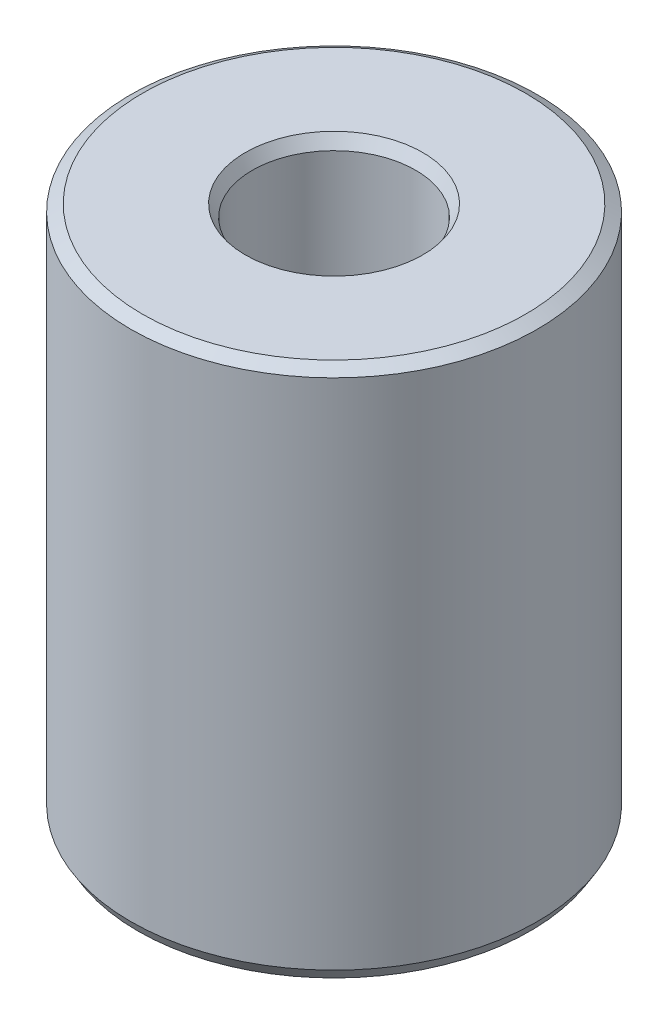
ISO-10303-21;
HEADER;
FILE_DESCRIPTION(('STEP AP214'),'2;1');
FILE_NAME('part.step','',(''),(''),'','','');
FILE_SCHEMA(('AUTOMOTIVE_DESIGN { 1 0 10303 214 1 1 1 1 }'));
ENDSEC;
DATA;
#1=APPLICATION_CONTEXT('core data for automotive mechanical design processes');
#2=APPLICATION_PROTOCOL_DEFINITION('international standard','automotive_design',2000,#1);
#3=PRODUCT_CONTEXT('',#1,'mechanical');
#4=PRODUCT('Part','Part','',(#3));
#5=PRODUCT_RELATED_PRODUCT_CATEGORY('part','',(#4));
#6=PRODUCT_DEFINITION_FORMATION('','',#4);
#7=PRODUCT_DEFINITION_CONTEXT('part definition',#1,'design');
#8=PRODUCT_DEFINITION('design','',#6,#7);
#9=PRODUCT_DEFINITION_SHAPE('','',#8);
#10=(LENGTH_UNIT() NAMED_UNIT(*) SI_UNIT(.MILLI.,.METRE.));
#11=(NAMED_UNIT(*) PLANE_ANGLE_UNIT() SI_UNIT($,.RADIAN.));
#12=(NAMED_UNIT(*) SI_UNIT($,.STERADIAN.) SOLID_ANGLE_UNIT());
#13=UNCERTAINTY_MEASURE_WITH_UNIT(LENGTH_MEASURE(1.E-05),#10,'distance_accuracy_value','');
#14=(GEOMETRIC_REPRESENTATION_CONTEXT(3) GLOBAL_UNCERTAINTY_ASSIGNED_CONTEXT((#13)) GLOBAL_UNIT_ASSIGNED_CONTEXT((#10,
#11,#12)) REPRESENTATION_CONTEXT('',''));
#15=CARTESIAN_POINT('',(0.,0.,0.));
#16=DIRECTION('',(0.,0.,1.));
#17=DIRECTION('',(1.,0.,0.));
#18=AXIS2_PLACEMENT_3D('',#15,#16,#17);
#19=CARTESIAN_POINT('',(0.,58.8666773430447,0.));
#20=DIRECTION('',(0.,-1.,0.));
#21=DIRECTION('',(0.,0.,-1.));
#22=AXIS2_PLACEMENT_3D('',#19,#20,#21);
#23=CYLINDRICAL_SURFACE('',#22,22.5);
#24=CARTESIAN_POINT('',(0.,1.30393393738187,0.));
#25=DIRECTION('',(0.,1.,0.));
#26=DIRECTION('',(0.,0.,1.));
#27=AXIS2_PLACEMENT_3D('',#24,#25,#26);
#28=CIRCLE('',#27,22.5);
#29=CARTESIAN_POINT('',(0.,1.30393393738187,22.5));
#30=VERTEX_POINT('',#29);
#31=EDGE_CURVE('E10',#30,#30,#28,.T.);
#32=ORIENTED_EDGE('',*,*,#31,.T.);
#33=EDGE_LOOP('',(#32));
#34=FACE_BOUND('',#33,.T.);
#35=CARTESIAN_POINT('',(0.,58.0814540573901,0.));
#36=DIRECTION('',(0.,1.,0.));
#37=DIRECTION('',(0.,0.,1.));
#38=AXIS2_PLACEMENT_3D('',#35,#36,#37);
#39=CIRCLE('',#38,22.5);
#40=CARTESIAN_POINT('',(0.,58.0814540573901,22.5));
#41=VERTEX_POINT('',#40);
#42=EDGE_CURVE('E50',#41,#41,#39,.F.);
#43=ORIENTED_EDGE('',*,*,#42,.T.);
#44=EDGE_LOOP('',(#43));
#45=FACE_BOUND('',#44,.T.);
#46=ADVANCED_FACE('F39',(#34,#45),#23,.T.);
#47=CARTESIAN_POINT('',(0.,58.8666773430447,0.));
#48=DIRECTION('',(0.,1.,0.));
#49=DIRECTION('',(0.,0.,1.));
#50=AXIS2_PLACEMENT_3D('',#47,#48,#49);
#51=PLANE('',#50);
#52=CARTESIAN_POINT('',(0.,58.8666773430447,0.));
#53=DIRECTION('',(0.,1.,0.));
#54=DIRECTION('',(0.,0.,1.));
#55=AXIS2_PLACEMENT_3D('',#52,#53,#54);
#56=CIRCLE('',#55,9.82424820602042);
#57=CARTESIAN_POINT('',(0.,58.8666773430447,9.82424820602042));
#58=VERTEX_POINT('',#57);
#59=EDGE_CURVE('E58',#58,#58,#56,.F.);
#60=ORIENTED_EDGE('',*,*,#59,.T.);
#61=EDGE_LOOP('',(#60));
#62=FACE_BOUND('',#61,.T.);
#63=CARTESIAN_POINT('',(0.,58.8666773430447,0.));
#64=DIRECTION('',(0.,1.,0.));
#65=DIRECTION('',(0.,0.,1.));
#66=AXIS2_PLACEMENT_3D('',#63,#64,#65);
#67=CIRCLE('',#66,21.1960660626182);
#68=CARTESIAN_POINT('',(0.,58.8666773430447,21.1960660626182));
#69=VERTEX_POINT('',#68);
#70=EDGE_CURVE('E61',#69,#69,#67,.T.);
#71=ORIENTED_EDGE('',*,*,#70,.T.);
#72=EDGE_LOOP('',(#71));
#73=FACE_BOUND('',#72,.T.);
#74=ADVANCED_FACE('F88',(#62,#73),#51,.T.);
#75=CARTESIAN_POINT('',(0.,0.,0.));
#76=DIRECTION('',(0.,1.,0.));
#77=DIRECTION('',(0.,0.,1.));
#78=AXIS2_PLACEMENT_3D('',#75,#76,#77);
#79=PLANE('',#78);
#80=CARTESIAN_POINT('',(0.,0.,0.));
#81=DIRECTION('',(0.,1.,0.));
#82=DIRECTION('',(0.,0.,1.));
#83=AXIS2_PLACEMENT_3D('',#80,#81,#82);
#84=CIRCLE('',#83,10.3429588577477);
#85=CARTESIAN_POINT('',(0.,0.,10.3429588577477));
#86=VERTEX_POINT('',#85);
#87=EDGE_CURVE('E51',#86,#86,#84,.T.);
#88=ORIENTED_EDGE('',*,*,#87,.T.);
#89=EDGE_LOOP('',(#88));
#90=FACE_BOUND('',#89,.T.);
#91=CARTESIAN_POINT('',(0.,0.,0.));
#92=DIRECTION('',(0.,1.,0.));
#93=DIRECTION('',(0.,0.,1.));
#94=AXIS2_PLACEMENT_3D('',#91,#92,#93);
#95=CIRCLE('',#94,21.7147767143454);
#96=CARTESIAN_POINT('',(0.,0.,21.7147767143454));
#97=VERTEX_POINT('',#96);
#98=EDGE_CURVE('E54',#97,#97,#95,.F.);
#99=ORIENTED_EDGE('',*,*,#98,.T.);
#100=EDGE_LOOP('',(#99));
#101=FACE_BOUND('',#100,.T.);
#102=ADVANCED_FACE('F83',(#90,#101),#79,.F.);
#103=CARTESIAN_POINT('',(0.,58.8666773430447,0.));
#104=DIRECTION('',(0.,-1.,0.));
#105=DIRECTION('',(0.,0.,-1.));
#106=AXIS2_PLACEMENT_3D('',#103,#104,#105);
#107=CYLINDRICAL_SURFACE('',#106,9.03902492036584);
#108=CARTESIAN_POINT('',(0.,57.5627434056629,0.));
#109=DIRECTION('',(0.,1.,0.));
#110=DIRECTION('',(0.,0.,1.));
#111=AXIS2_PLACEMENT_3D('',#108,#109,#110);
#112=CIRCLE('',#111,9.03902492036584);
#113=CARTESIAN_POINT('',(0.,57.5627434056629,9.03902492036584));
#114=VERTEX_POINT('',#113);
#115=EDGE_CURVE('E67',#114,#114,#112,.T.);
#116=ORIENTED_EDGE('',*,*,#115,.T.);
#117=EDGE_LOOP('',(#116));
#118=FACE_BOUND('',#117,.T.);
#119=CARTESIAN_POINT('',(0.,0.785223285654592,0.));
#120=DIRECTION('',(0.,1.,0.));
#121=DIRECTION('',(0.,0.,1.));
#122=AXIS2_PLACEMENT_3D('',#119,#120,#121);
#123=CIRCLE('',#122,9.03902492036584);
#124=CARTESIAN_POINT('',(0.,0.785223285654592,9.03902492036584));
#125=VERTEX_POINT('',#124);
#126=EDGE_CURVE('E69',#125,#125,#123,.F.);
#127=ORIENTED_EDGE('',*,*,#126,.T.);
#128=EDGE_LOOP('',(#127));
#129=FACE_BOUND('',#128,.T.);
#130=ADVANCED_FACE('F71',(#118,#129),#107,.F.);
#131=CARTESIAN_POINT('',(0.,57.5627434056629,0.));
#132=DIRECTION('',(0.,1.,0.));
#133=DIRECTION('',(0.,0.,1.));
#134=AXIS2_PLACEMENT_3D('',#131,#132,#133);
#135=CONICAL_SURFACE('',#134,9.03902492036584,0.542032351660038);
#136=ORIENTED_EDGE('',*,*,#59,.F.);
#137=EDGE_LOOP('',(#136));
#138=FACE_BOUND('',#137,.T.);
#139=ORIENTED_EDGE('',*,*,#115,.F.);
#140=EDGE_LOOP('',(#139));
#141=FACE_BOUND('',#140,.T.);
#142=ADVANCED_FACE('F77',(#138,#141),#135,.F.);
#143=CARTESIAN_POINT('',(0.,0.,0.));
#144=DIRECTION('',(0.,-1.,0.));
#145=DIRECTION('',(0.,0.,-1.));
#146=AXIS2_PLACEMENT_3D('',#143,#144,#145);
#147=CONICAL_SURFACE('',#146,10.3429588577477,1.02876397513485);
#148=ORIENTED_EDGE('',*,*,#126,.F.);
#149=EDGE_LOOP('',(#148));
#150=FACE_BOUND('',#149,.T.);
#151=ORIENTED_EDGE('',*,*,#87,.F.);
#152=EDGE_LOOP('',(#151));
#153=FACE_BOUND('',#152,.T.);
#154=ADVANCED_FACE('F73',(#150,#153),#147,.F.);
#155=CARTESIAN_POINT('',(0.,1.30393393738187,0.));
#156=DIRECTION('',(0.,1.,0.));
#157=DIRECTION('',(0.,0.,1.));
#158=AXIS2_PLACEMENT_3D('',#155,#156,#157);
#159=CONICAL_SURFACE('',#158,22.5,0.542032351660043);
#160=ORIENTED_EDGE('',*,*,#98,.F.);
#161=EDGE_LOOP('',(#160));
#162=FACE_BOUND('',#161,.T.);
#163=ORIENTED_EDGE('',*,*,#31,.F.);
#164=EDGE_LOOP('',(#163));
#165=FACE_BOUND('',#164,.T.);
#166=ADVANCED_FACE('F76',(#162,#165),#159,.T.);
#167=CARTESIAN_POINT('',(0.,58.8666773430447,0.));
#168=DIRECTION('',(0.,-1.,0.));
#169=DIRECTION('',(0.,0.,-1.));
#170=AXIS2_PLACEMENT_3D('',#167,#168,#169);
#171=CONICAL_SURFACE('',#170,21.1960660626182,1.02876397513485);
#172=ORIENTED_EDGE('',*,*,#42,.F.);
#173=EDGE_LOOP('',(#172));
#174=FACE_BOUND('',#173,.T.);
#175=ORIENTED_EDGE('',*,*,#70,.F.);
#176=EDGE_LOOP('',(#175));
#177=FACE_BOUND('',#176,.T.);
#178=ADVANCED_FACE('F45',(#174,#177),#171,.T.);
#179=CLOSED_SHELL('',(#46,#74,#102,#130,#142,#154,#166,#178));
#180=MANIFOLD_SOLID_BREP('B2',#179);
#181=ADVANCED_BREP_SHAPE_REPRESENTATION('',(#18,#180),#14);
#182=SHAPE_DEFINITION_REPRESENTATION(#9,#181);
ENDSEC;
END-ISO-10303-21;
